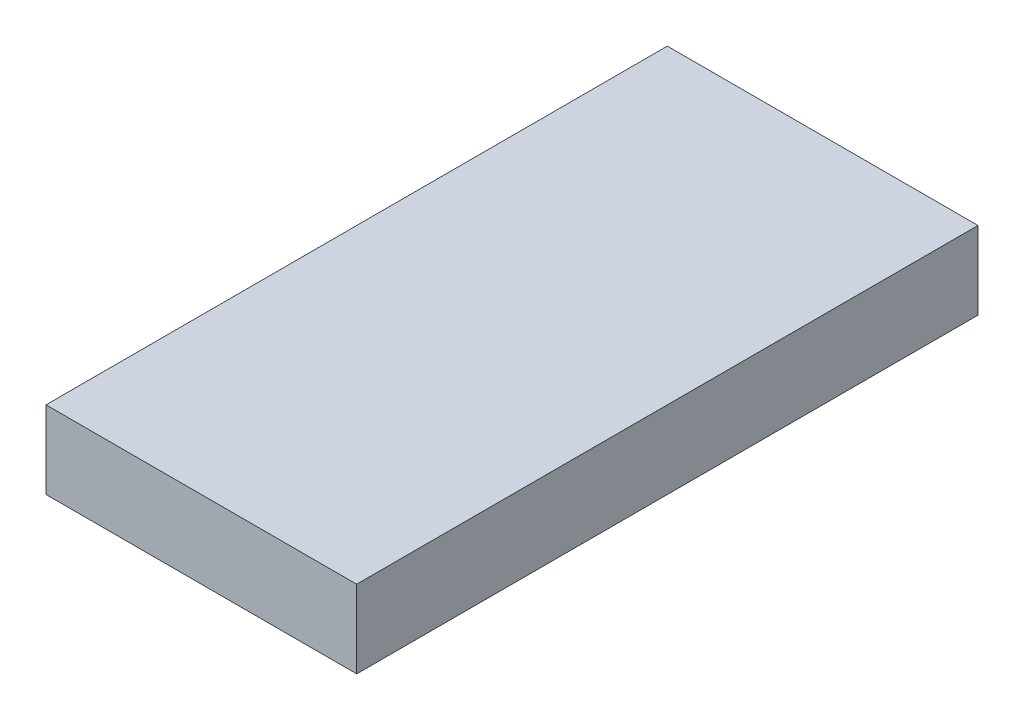
ISO-10303-21;
HEADER;
FILE_DESCRIPTION(('STEP AP214'),'2;1');
FILE_NAME('part.step','',(''),(''),'','','');
FILE_SCHEMA(('AUTOMOTIVE_DESIGN { 1 0 10303 214 1 1 1 1 }'));
ENDSEC;
DATA;
#1=APPLICATION_CONTEXT('core data for automotive mechanical design processes');
#2=APPLICATION_PROTOCOL_DEFINITION('international standard','automotive_design',2000,#1);
#3=PRODUCT_CONTEXT('',#1,'mechanical');
#4=PRODUCT('Part','Part','',(#3));
#5=PRODUCT_RELATED_PRODUCT_CATEGORY('part','',(#4));
#6=PRODUCT_DEFINITION_FORMATION('','',#4);
#7=PRODUCT_DEFINITION_CONTEXT('part definition',#1,'design');
#8=PRODUCT_DEFINITION('design','',#6,#7);
#9=PRODUCT_DEFINITION_SHAPE('','',#8);
#10=(LENGTH_UNIT() NAMED_UNIT(*) SI_UNIT(.MILLI.,.METRE.));
#11=(NAMED_UNIT(*) PLANE_ANGLE_UNIT() SI_UNIT($,.RADIAN.));
#12=(NAMED_UNIT(*) SI_UNIT($,.STERADIAN.) SOLID_ANGLE_UNIT());
#13=UNCERTAINTY_MEASURE_WITH_UNIT(LENGTH_MEASURE(1.E-05),#10,'distance_accuracy_value','');
#14=(GEOMETRIC_REPRESENTATION_CONTEXT(3) GLOBAL_UNCERTAINTY_ASSIGNED_CONTEXT((#13)) GLOBAL_UNIT_ASSIGNED_CONTEXT((#10,
#11,#12)) REPRESENTATION_CONTEXT('',''));
#15=CARTESIAN_POINT('',(0.,0.,0.));
#16=DIRECTION('',(0.,0.,1.));
#17=DIRECTION('',(1.,0.,0.));
#18=AXIS2_PLACEMENT_3D('',#15,#16,#17);
#19=CARTESIAN_POINT('',(1.5875,0.79375,-3.175));
#20=DIRECTION('',(-1.,0.,0.));
#21=DIRECTION('',(0.,0.,1.));
#22=AXIS2_PLACEMENT_3D('',#19,#20,#21);
#23=PLANE('',#22);
#24=DIRECTION('',(0.,0.,-1.));
#25=VECTOR('',#24,1.);
#26=CARTESIAN_POINT('',(1.5875,0.,-3.175));
#27=LINE('',#26,#25);
#28=CARTESIAN_POINT('',(1.5875,0.,3.175));
#29=VERTEX_POINT('',#28);
#30=CARTESIAN_POINT('',(1.5875,0.,-3.175));
#31=VERTEX_POINT('',#30);
#32=EDGE_CURVE('E97',#29,#31,#27,.T.);
#33=ORIENTED_EDGE('',*,*,#32,.T.);
#34=DIRECTION('',(0.,-1.,0.));
#35=VECTOR('',#34,1.);
#36=CARTESIAN_POINT('',(1.5875,0.79375,-3.175));
#37=LINE('',#36,#35);
#38=CARTESIAN_POINT('',(1.5875,0.79375,-3.175));
#39=VERTEX_POINT('',#38);
#40=EDGE_CURVE('E11',#39,#31,#37,.T.);
#41=ORIENTED_EDGE('',*,*,#40,.F.);
#42=DIRECTION('',(0.,0.,-1.));
#43=VECTOR('',#42,1.);
#44=CARTESIAN_POINT('',(1.5875,0.79375,-3.175));
#45=LINE('',#44,#43);
#46=CARTESIAN_POINT('',(1.5875,0.79375,3.175));
#47=VERTEX_POINT('',#46);
#48=EDGE_CURVE('E85',#47,#39,#45,.T.);
#49=ORIENTED_EDGE('',*,*,#48,.F.);
#50=DIRECTION('',(0.,-1.,0.));
#51=VECTOR('',#50,1.);
#52=CARTESIAN_POINT('',(1.5875,0.79375,3.175));
#53=LINE('',#52,#51);
#54=EDGE_CURVE('E93',#47,#29,#53,.T.);
#55=ORIENTED_EDGE('',*,*,#54,.T.);
#56=EDGE_LOOP('',(#33,#41,#49,#55));
#57=FACE_BOUND('',#56,.T.);
#58=ADVANCED_FACE('F34',(#57),#23,.F.);
#59=CARTESIAN_POINT('',(-1.5875,0.79375,-3.175));
#60=DIRECTION('',(0.,0.,1.));
#61=DIRECTION('',(1.,0.,0.));
#62=AXIS2_PLACEMENT_3D('',#59,#60,#61);
#63=PLANE('',#62);
#64=DIRECTION('',(-1.,0.,0.));
#65=VECTOR('',#64,1.);
#66=CARTESIAN_POINT('',(-1.5875,0.,-3.175));
#67=LINE('',#66,#65);
#68=CARTESIAN_POINT('',(-1.5875,0.,-3.175));
#69=VERTEX_POINT('',#68);
#70=EDGE_CURVE('E89',#31,#69,#67,.T.);
#71=ORIENTED_EDGE('',*,*,#70,.T.);
#72=DIRECTION('',(0.,-1.,0.));
#73=VECTOR('',#72,1.);
#74=CARTESIAN_POINT('',(-1.5875,0.79375,-3.175));
#75=LINE('',#74,#73);
#76=CARTESIAN_POINT('',(-1.5875,0.79375,-3.175));
#77=VERTEX_POINT('',#76);
#78=EDGE_CURVE('E42',#77,#69,#75,.T.);
#79=ORIENTED_EDGE('',*,*,#78,.F.);
#80=DIRECTION('',(-1.,0.,0.));
#81=VECTOR('',#80,1.);
#82=CARTESIAN_POINT('',(-1.5875,0.79375,-3.175));
#83=LINE('',#82,#81);
#84=EDGE_CURVE('E80',#39,#77,#83,.T.);
#85=ORIENTED_EDGE('',*,*,#84,.F.);
#86=ORIENTED_EDGE('',*,*,#40,.T.);
#87=EDGE_LOOP('',(#71,#79,#85,#86));
#88=FACE_BOUND('',#87,.T.);
#89=ADVANCED_FACE('F88',(#88),#63,.F.);
#90=CARTESIAN_POINT('',(-1.5875,0.79375,-3.175));
#91=DIRECTION('',(1.,0.,0.));
#92=DIRECTION('',(0.,0.,-1.));
#93=AXIS2_PLACEMENT_3D('',#90,#91,#92);
#94=PLANE('',#93);
#95=DIRECTION('',(0.,0.,1.));
#96=VECTOR('',#95,1.);
#97=CARTESIAN_POINT('',(-1.5875,0.,-3.175));
#98=LINE('',#97,#96);
#99=CARTESIAN_POINT('',(-1.5875,0.,3.175));
#100=VERTEX_POINT('',#99);
#101=EDGE_CURVE('E67',#69,#100,#98,.T.);
#102=ORIENTED_EDGE('',*,*,#101,.T.);
#103=DIRECTION('',(0.,-1.,0.));
#104=VECTOR('',#103,1.);
#105=CARTESIAN_POINT('',(-1.5875,0.79375,3.175));
#106=LINE('',#105,#104);
#107=CARTESIAN_POINT('',(-1.5875,0.79375,3.175));
#108=VERTEX_POINT('',#107);
#109=EDGE_CURVE('E90',#108,#100,#106,.T.);
#110=ORIENTED_EDGE('',*,*,#109,.F.);
#111=DIRECTION('',(0.,0.,1.));
#112=VECTOR('',#111,1.);
#113=CARTESIAN_POINT('',(-1.5875,0.79375,-3.175));
#114=LINE('',#113,#112);
#115=EDGE_CURVE('E83',#77,#108,#114,.T.);
#116=ORIENTED_EDGE('',*,*,#115,.F.);
#117=ORIENTED_EDGE('',*,*,#78,.T.);
#118=EDGE_LOOP('',(#102,#110,#116,#117));
#119=FACE_BOUND('',#118,.T.);
#120=ADVANCED_FACE('F91',(#119),#94,.F.);
#121=CARTESIAN_POINT('',(-1.5875,0.79375,3.175));
#122=DIRECTION('',(0.,0.,-1.));
#123=DIRECTION('',(-1.,0.,0.));
#124=AXIS2_PLACEMENT_3D('',#121,#122,#123);
#125=PLANE('',#124);
#126=DIRECTION('',(1.,0.,0.));
#127=VECTOR('',#126,1.);
#128=CARTESIAN_POINT('',(-1.5875,0.,3.175));
#129=LINE('',#128,#127);
#130=EDGE_CURVE('E73',#100,#29,#129,.T.);
#131=ORIENTED_EDGE('',*,*,#130,.T.);
#132=ORIENTED_EDGE('',*,*,#54,.F.);
#133=DIRECTION('',(1.,0.,0.));
#134=VECTOR('',#133,1.);
#135=CARTESIAN_POINT('',(-1.5875,0.79375,3.175));
#136=LINE('',#135,#134);
#137=EDGE_CURVE('E50',#108,#47,#136,.T.);
#138=ORIENTED_EDGE('',*,*,#137,.F.);
#139=ORIENTED_EDGE('',*,*,#109,.T.);
#140=EDGE_LOOP('',(#131,#132,#138,#139));
#141=FACE_BOUND('',#140,.T.);
#142=ADVANCED_FACE('F104',(#141),#125,.F.);
#143=CARTESIAN_POINT('',(0.,0.79375,0.));
#144=DIRECTION('',(0.,1.,0.));
#145=DIRECTION('',(0.,0.,1.));
#146=AXIS2_PLACEMENT_3D('',#143,#144,#145);
#147=PLANE('',#146);
#148=ORIENTED_EDGE('',*,*,#48,.T.);
#149=ORIENTED_EDGE('',*,*,#84,.T.);
#150=ORIENTED_EDGE('',*,*,#115,.T.);
#151=ORIENTED_EDGE('',*,*,#137,.T.);
#152=EDGE_LOOP('',(#148,#149,#150,#151));
#153=FACE_BOUND('',#152,.T.);
#154=ADVANCED_FACE('F81',(#153),#147,.T.);
#155=CARTESIAN_POINT('',(0.,0.,0.));
#156=DIRECTION('',(0.,1.,0.));
#157=DIRECTION('',(0.,0.,1.));
#158=AXIS2_PLACEMENT_3D('',#155,#156,#157);
#159=PLANE('',#158);
#160=ORIENTED_EDGE('',*,*,#32,.F.);
#161=ORIENTED_EDGE('',*,*,#130,.F.);
#162=ORIENTED_EDGE('',*,*,#101,.F.);
#163=ORIENTED_EDGE('',*,*,#70,.F.);
#164=EDGE_LOOP('',(#160,#161,#162,#163));
#165=FACE_BOUND('',#164,.T.);
#166=ADVANCED_FACE('F107',(#165),#159,.F.);
#167=CLOSED_SHELL('',(#58,#89,#120,#142,#154,#166));
#168=MANIFOLD_SOLID_BREP('B2',#167);
#169=ADVANCED_BREP_SHAPE_REPRESENTATION('',(#18,#168),#14);
#170=SHAPE_DEFINITION_REPRESENTATION(#9,#169);
ENDSEC;
END-ISO-10303-21;
